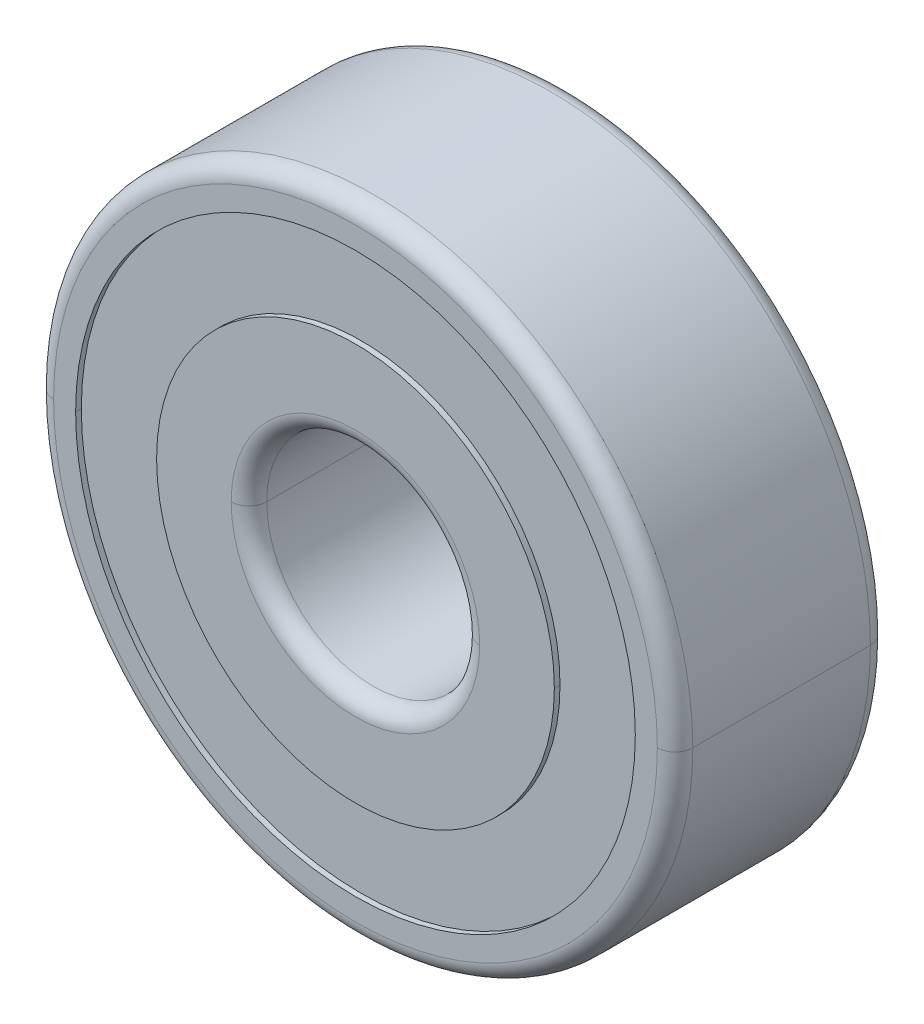
ISO-10303-21;
HEADER;
FILE_DESCRIPTION(('STEP AP214'),'2;1');
FILE_NAME('part.step','',(''),(''),'','','');
FILE_SCHEMA(('AUTOMOTIVE_DESIGN { 1 0 10303 214 1 1 1 1 }'));
ENDSEC;
DATA;
#1=APPLICATION_CONTEXT('core data for automotive mechanical design processes');
#2=APPLICATION_PROTOCOL_DEFINITION('international standard','automotive_design',2000,#1);
#3=PRODUCT_CONTEXT('',#1,'mechanical');
#4=PRODUCT('Part','Part','',(#3));
#5=PRODUCT_RELATED_PRODUCT_CATEGORY('part','',(#4));
#6=PRODUCT_DEFINITION_FORMATION('','',#4);
#7=PRODUCT_DEFINITION_CONTEXT('part definition',#1,'design');
#8=PRODUCT_DEFINITION('design','',#6,#7);
#9=PRODUCT_DEFINITION_SHAPE('','',#8);
#10=(LENGTH_UNIT() NAMED_UNIT(*) SI_UNIT(.MILLI.,.METRE.));
#11=(NAMED_UNIT(*) PLANE_ANGLE_UNIT() SI_UNIT($,.RADIAN.));
#12=(NAMED_UNIT(*) SI_UNIT($,.STERADIAN.) SOLID_ANGLE_UNIT());
#13=UNCERTAINTY_MEASURE_WITH_UNIT(LENGTH_MEASURE(1.E-05),#10,'distance_accuracy_value','');
#14=(GEOMETRIC_REPRESENTATION_CONTEXT(3) GLOBAL_UNCERTAINTY_ASSIGNED_CONTEXT((#13)) GLOBAL_UNIT_ASSIGNED_CONTEXT((#10,
#11,#12)) REPRESENTATION_CONTEXT('',''));
#15=CARTESIAN_POINT('',(0.,0.,0.));
#16=DIRECTION('',(0.,0.,1.));
#17=DIRECTION('',(1.,0.,0.));
#18=AXIS2_PLACEMENT_3D('',#15,#16,#17);
#19=CARTESIAN_POINT('',(0.,0.,-4.5085));
#20=DIRECTION('',(0.,0.,-1.));
#21=DIRECTION('',(-1.,0.,0.));
#22=AXIS2_PLACEMENT_3D('',#19,#20,#21);
#23=CYLINDRICAL_SURFACE('',#22,8.89);
#24=DIRECTION('',(0.,0.,-1.));
#25=VECTOR('',#24,1.);
#26=CARTESIAN_POINT('',(8.89,0.,-4.5085));
#27=LINE('',#26,#25);
#28=CARTESIAN_POINT('',(8.89,0.,-4.5085));
#29=VERTEX_POINT('',#28);
#30=CARTESIAN_POINT('',(8.89,0.,-4.7625));
#31=VERTEX_POINT('',#30);
#32=EDGE_CURVE('E390',#29,#31,#27,.T.);
#33=ORIENTED_EDGE('',*,*,#32,.F.);
#34=CARTESIAN_POINT('',(0.,0.,-4.5085));
#35=DIRECTION('',(0.,0.,1.));
#36=DIRECTION('',(1.,0.,0.));
#37=AXIS2_PLACEMENT_3D('',#34,#35,#36);
#38=CIRCLE('',#37,8.89);
#39=CARTESIAN_POINT('',(-8.89,0.,-4.5085));
#40=VERTEX_POINT('',#39);
#41=EDGE_CURVE('E11',#40,#29,#38,.T.);
#42=ORIENTED_EDGE('',*,*,#41,.F.);
#43=DIRECTION('',(0.,0.,-1.));
#44=VECTOR('',#43,1.);
#45=CARTESIAN_POINT('',(-8.89,0.,-4.5085));
#46=LINE('',#45,#44);
#47=CARTESIAN_POINT('',(-8.89,0.,-4.7625));
#48=VERTEX_POINT('',#47);
#49=EDGE_CURVE('E347',#40,#48,#46,.T.);
#50=ORIENTED_EDGE('',*,*,#49,.T.);
#51=CARTESIAN_POINT('',(0.,0.,-4.7625));
#52=DIRECTION('',(0.,0.,1.));
#53=DIRECTION('',(1.,0.,0.));
#54=AXIS2_PLACEMENT_3D('',#51,#52,#53);
#55=CIRCLE('',#54,8.89);
#56=EDGE_CURVE('E301',#48,#31,#55,.T.);
#57=ORIENTED_EDGE('',*,*,#56,.T.);
#58=EDGE_LOOP('',(#33,#42,#50,#57));
#59=FACE_BOUND('',#58,.T.);
#60=ADVANCED_FACE('F16',(#59),#23,.T.);
#61=CARTESIAN_POINT('',(0.,0.,-4.5085));
#62=DIRECTION('',(0.,0.,-1.));
#63=DIRECTION('',(-1.,0.,0.));
#64=AXIS2_PLACEMENT_3D('',#61,#62,#63);
#65=CYLINDRICAL_SURFACE('',#64,12.5095);
#66=DIRECTION('',(0.,0.,-1.));
#67=VECTOR('',#66,1.);
#68=CARTESIAN_POINT('',(12.5095,0.,-4.5085));
#69=LINE('',#68,#67);
#70=CARTESIAN_POINT('',(12.5095,0.,-4.5085));
#71=VERTEX_POINT('',#70);
#72=CARTESIAN_POINT('',(12.5095,0.,-4.7625));
#73=VERTEX_POINT('',#72);
#74=EDGE_CURVE('E338',#71,#73,#69,.T.);
#75=ORIENTED_EDGE('',*,*,#74,.F.);
#76=CARTESIAN_POINT('',(0.,0.,-4.5085));
#77=DIRECTION('',(0.,0.,1.));
#78=DIRECTION('',(1.,0.,0.));
#79=AXIS2_PLACEMENT_3D('',#76,#77,#78);
#80=CIRCLE('',#79,12.5095);
#81=CARTESIAN_POINT('',(-12.5095,0.,-4.5085));
#82=VERTEX_POINT('',#81);
#83=EDGE_CURVE('E25',#71,#82,#80,.T.);
#84=ORIENTED_EDGE('',*,*,#83,.T.);
#85=DIRECTION('',(0.,0.,-1.));
#86=VECTOR('',#85,1.);
#87=CARTESIAN_POINT('',(-12.5095,0.,-4.5085));
#88=LINE('',#87,#86);
#89=CARTESIAN_POINT('',(-12.5095,0.,-4.7625));
#90=VERTEX_POINT('',#89);
#91=EDGE_CURVE('E204',#82,#90,#88,.T.);
#92=ORIENTED_EDGE('',*,*,#91,.T.);
#93=CARTESIAN_POINT('',(0.,0.,-4.7625));
#94=DIRECTION('',(0.,0.,1.));
#95=DIRECTION('',(1.,0.,0.));
#96=AXIS2_PLACEMENT_3D('',#93,#94,#95);
#97=CIRCLE('',#96,12.5095);
#98=EDGE_CURVE('E180',#73,#90,#97,.T.);
#99=ORIENTED_EDGE('',*,*,#98,.F.);
#100=EDGE_LOOP('',(#75,#84,#92,#99));
#101=FACE_BOUND('',#100,.T.);
#102=ADVANCED_FACE('F331',(#101),#65,.F.);
#103=CARTESIAN_POINT('',(0.,0.,-4.5085));
#104=DIRECTION('',(0.,0.,-1.));
#105=DIRECTION('',(0.,-1.,0.));
#106=AXIS2_PLACEMENT_3D('',#103,#104,#105);
#107=PLANE('',#106);
#108=ORIENTED_EDGE('',*,*,#41,.T.);
#109=CARTESIAN_POINT('',(0.,0.,-4.5085));
#110=DIRECTION('',(0.,0.,1.));
#111=DIRECTION('',(1.,0.,0.));
#112=AXIS2_PLACEMENT_3D('',#109,#110,#111);
#113=CIRCLE('',#112,8.89);
#114=EDGE_CURVE('E382',#29,#40,#113,.T.);
#115=ORIENTED_EDGE('',*,*,#114,.T.);
#116=EDGE_LOOP('',(#108,#115));
#117=FACE_BOUND('',#116,.T.);
#118=CARTESIAN_POINT('',(0.,0.,-4.5085));
#119=DIRECTION('',(0.,0.,1.));
#120=DIRECTION('',(1.,0.,0.));
#121=AXIS2_PLACEMENT_3D('',#118,#119,#120);
#122=CIRCLE('',#121,12.5095);
#123=EDGE_CURVE('E341',#82,#71,#122,.T.);
#124=ORIENTED_EDGE('',*,*,#123,.F.);
#125=ORIENTED_EDGE('',*,*,#83,.F.);
#126=EDGE_LOOP('',(#124,#125));
#127=FACE_BOUND('',#126,.T.);
#128=ADVANCED_FACE('F431',(#117,#127),#107,.T.);
#129=CARTESIAN_POINT('',(0.,0.,4.5085));
#130=DIRECTION('',(0.,0.,1.));
#131=DIRECTION('',(1.,0.,0.));
#132=AXIS2_PLACEMENT_3D('',#129,#130,#131);
#133=CYLINDRICAL_SURFACE('',#132,8.89);
#134=DIRECTION('',(0.,0.,1.));
#135=VECTOR('',#134,1.);
#136=CARTESIAN_POINT('',(-8.89,0.,4.5085));
#137=LINE('',#136,#135);
#138=CARTESIAN_POINT('',(-8.89,0.,4.5085));
#139=VERTEX_POINT('',#138);
#140=CARTESIAN_POINT('',(-8.89,0.,4.7625));
#141=VERTEX_POINT('',#140);
#142=EDGE_CURVE('E220',#139,#141,#137,.T.);
#143=ORIENTED_EDGE('',*,*,#142,.F.);
#144=CARTESIAN_POINT('',(0.,0.,4.5085));
#145=DIRECTION('',(0.,0.,1.));
#146=DIRECTION('',(1.,0.,0.));
#147=AXIS2_PLACEMENT_3D('',#144,#145,#146);
#148=CIRCLE('',#147,8.89);
#149=CARTESIAN_POINT('',(8.89,0.,4.5085));
#150=VERTEX_POINT('',#149);
#151=EDGE_CURVE('E19',#139,#150,#148,.T.);
#152=ORIENTED_EDGE('',*,*,#151,.T.);
#153=DIRECTION('',(0.,0.,1.));
#154=VECTOR('',#153,1.);
#155=CARTESIAN_POINT('',(8.89,0.,4.5085));
#156=LINE('',#155,#154);
#157=CARTESIAN_POINT('',(8.89,0.,4.7625));
#158=VERTEX_POINT('',#157);
#159=EDGE_CURVE('E192',#150,#158,#156,.T.);
#160=ORIENTED_EDGE('',*,*,#159,.T.);
#161=CARTESIAN_POINT('',(0.,0.,4.7625));
#162=DIRECTION('',(0.,0.,1.));
#163=DIRECTION('',(1.,0.,0.));
#164=AXIS2_PLACEMENT_3D('',#161,#162,#163);
#165=CIRCLE('',#164,8.89);
#166=EDGE_CURVE('E310',#141,#158,#165,.T.);
#167=ORIENTED_EDGE('',*,*,#166,.F.);
#168=EDGE_LOOP('',(#143,#152,#160,#167));
#169=FACE_BOUND('',#168,.T.);
#170=ADVANCED_FACE('F436',(#169),#133,.T.);
#171=CARTESIAN_POINT('',(0.,0.,4.5085));
#172=DIRECTION('',(0.,0.,1.));
#173=DIRECTION('',(1.,0.,0.));
#174=AXIS2_PLACEMENT_3D('',#171,#172,#173);
#175=PLANE('',#174);
#176=CARTESIAN_POINT('',(0.,0.,4.5085));
#177=DIRECTION('',(0.,0.,1.));
#178=DIRECTION('',(1.,0.,0.));
#179=AXIS2_PLACEMENT_3D('',#176,#177,#178);
#180=CIRCLE('',#179,8.89);
#181=EDGE_CURVE('E208',#150,#139,#180,.T.);
#182=ORIENTED_EDGE('',*,*,#181,.F.);
#183=ORIENTED_EDGE('',*,*,#151,.F.);
#184=EDGE_LOOP('',(#182,#183));
#185=FACE_BOUND('',#184,.T.);
#186=CARTESIAN_POINT('',(0.,0.,4.5085));
#187=DIRECTION('',(0.,0.,1.));
#188=DIRECTION('',(1.,0.,0.));
#189=AXIS2_PLACEMENT_3D('',#186,#187,#188);
#190=CIRCLE('',#189,12.5095);
#191=CARTESIAN_POINT('',(12.5095,0.,4.5085));
#192=VERTEX_POINT('',#191);
#193=CARTESIAN_POINT('',(-12.5095,0.,4.5085));
#194=VERTEX_POINT('',#193);
#195=EDGE_CURVE('E169',#192,#194,#190,.T.);
#196=ORIENTED_EDGE('',*,*,#195,.T.);
#197=CARTESIAN_POINT('',(0.,0.,4.5085));
#198=DIRECTION('',(0.,0.,1.));
#199=DIRECTION('',(1.,0.,0.));
#200=AXIS2_PLACEMENT_3D('',#197,#198,#199);
#201=CIRCLE('',#200,12.5095);
#202=EDGE_CURVE('E172',#194,#192,#201,.T.);
#203=ORIENTED_EDGE('',*,*,#202,.T.);
#204=EDGE_LOOP('',(#196,#203));
#205=FACE_BOUND('',#204,.T.);
#206=ADVANCED_FACE('F168',(#185,#205),#175,.T.);
#207=CARTESIAN_POINT('',(0.,0.,4.5085));
#208=DIRECTION('',(0.,0.,1.));
#209=DIRECTION('',(1.,0.,0.));
#210=AXIS2_PLACEMENT_3D('',#207,#208,#209);
#211=CYLINDRICAL_SURFACE('',#210,12.5095);
#212=DIRECTION('',(0.,0.,1.));
#213=VECTOR('',#212,1.);
#214=CARTESIAN_POINT('',(-12.5095,0.,4.5085));
#215=LINE('',#214,#213);
#216=CARTESIAN_POINT('',(-12.5095,0.,4.7625));
#217=VERTEX_POINT('',#216);
#218=EDGE_CURVE('E176',#194,#217,#215,.T.);
#219=ORIENTED_EDGE('',*,*,#218,.F.);
#220=ORIENTED_EDGE('',*,*,#195,.F.);
#221=DIRECTION('',(0.,0.,1.));
#222=VECTOR('',#221,1.);
#223=CARTESIAN_POINT('',(12.5095,0.,4.5085));
#224=LINE('',#223,#222);
#225=CARTESIAN_POINT('',(12.5095,0.,4.7625));
#226=VERTEX_POINT('',#225);
#227=EDGE_CURVE('E188',#192,#226,#224,.T.);
#228=ORIENTED_EDGE('',*,*,#227,.T.);
#229=CARTESIAN_POINT('',(0.,0.,4.7625));
#230=DIRECTION('',(0.,0.,1.));
#231=DIRECTION('',(1.,0.,0.));
#232=AXIS2_PLACEMENT_3D('',#229,#230,#231);
#233=CIRCLE('',#232,12.5095);
#234=EDGE_CURVE('E185',#226,#217,#233,.T.);
#235=ORIENTED_EDGE('',*,*,#234,.T.);
#236=EDGE_LOOP('',(#219,#220,#228,#235));
#237=FACE_BOUND('',#236,.T.);
#238=ADVANCED_FACE('F178',(#237),#211,.F.);
#239=CARTESIAN_POINT('',(0.,0.,-4.7625));
#240=DIRECTION('',(0.,0.,1.));
#241=DIRECTION('',(1.,0.,0.));
#242=AXIS2_PLACEMENT_3D('',#239,#240,#241);
#243=PLANE('',#242);
#244=CARTESIAN_POINT('',(0.,0.,-4.7625));
#245=DIRECTION('',(0.,0.,1.));
#246=DIRECTION('',(1.,0.,0.));
#247=AXIS2_PLACEMENT_3D('',#244,#245,#246);
#248=CIRCLE('',#247,12.5095);
#249=EDGE_CURVE('E205',#90,#73,#248,.T.);
#250=ORIENTED_EDGE('',*,*,#249,.T.);
#251=ORIENTED_EDGE('',*,*,#98,.T.);
#252=EDGE_LOOP('',(#250,#251));
#253=FACE_BOUND('',#252,.T.);
#254=CARTESIAN_POINT('',(0.,0.,-4.7625));
#255=DIRECTION('',(0.,0.,-1.));
#256=DIRECTION('',(-1.,0.,0.));
#257=AXIS2_PLACEMENT_3D('',#254,#255,#256);
#258=CIRCLE('',#257,13.49375);
#259=CARTESIAN_POINT('',(-13.49375,0.,-4.7625));
#260=VERTEX_POINT('',#259);
#261=CARTESIAN_POINT('',(13.49375,0.,-4.7625));
#262=VERTEX_POINT('',#261);
#263=EDGE_CURVE('E221',#260,#262,#258,.T.);
#264=ORIENTED_EDGE('',*,*,#263,.T.);
#265=CARTESIAN_POINT('',(0.,0.,-4.7625));
#266=DIRECTION('',(0.,0.,-1.));
#267=DIRECTION('',(-1.,0.,0.));
#268=AXIS2_PLACEMENT_3D('',#265,#266,#267);
#269=CIRCLE('',#268,13.49375);
#270=EDGE_CURVE('E227',#262,#260,#269,.T.);
#271=ORIENTED_EDGE('',*,*,#270,.T.);
#272=EDGE_LOOP('',(#264,#271));
#273=FACE_BOUND('',#272,.T.);
#274=ADVANCED_FACE('F330',(#253,#273),#243,.F.);
#275=CARTESIAN_POINT('',(0.,0.,-3.96875));
#276=DIRECTION('',(0.,0.,1.));
#277=DIRECTION('',(-1.,0.,0.));
#278=AXIS2_PLACEMENT_3D('',#275,#276,#277);
#279=TOROIDAL_SURFACE('',#278,13.49375,0.79375);
#280=CARTESIAN_POINT('',(13.49375,0.,-3.96875));
#281=DIRECTION('',(0.,-1.,0.));
#282=DIRECTION('',(1.,0.,0.));
#283=AXIS2_PLACEMENT_3D('',#280,#281,#282);
#284=CIRCLE('',#283,0.79375);
#285=CARTESIAN_POINT('',(14.2875,0.,-3.96875));
#286=VERTEX_POINT('',#285);
#287=EDGE_CURVE('E230',#262,#286,#284,.T.);
#288=ORIENTED_EDGE('',*,*,#287,.F.);
#289=ORIENTED_EDGE('',*,*,#263,.F.);
#290=CARTESIAN_POINT('',(-13.49375,0.,-3.96875));
#291=DIRECTION('',(0.,1.,0.));
#292=DIRECTION('',(0.,0.,1.));
#293=AXIS2_PLACEMENT_3D('',#290,#291,#292);
#294=CIRCLE('',#293,0.79375);
#295=CARTESIAN_POINT('',(-14.2875,0.,-3.96875));
#296=VERTEX_POINT('',#295);
#297=EDGE_CURVE('E242',#260,#296,#294,.T.);
#298=ORIENTED_EDGE('',*,*,#297,.T.);
#299=CARTESIAN_POINT('',(0.,0.,-3.96875));
#300=DIRECTION('',(0.,0.,1.));
#301=DIRECTION('',(-1.,0.,0.));
#302=AXIS2_PLACEMENT_3D('',#299,#300,#301);
#303=CIRCLE('',#302,14.2875);
#304=EDGE_CURVE('E254',#286,#296,#303,.T.);
#305=ORIENTED_EDGE('',*,*,#304,.F.);
#306=EDGE_LOOP('',(#288,#289,#298,#305));
#307=FACE_BOUND('',#306,.T.);
#308=ADVANCED_FACE('F364',(#307),#279,.T.);
#309=CARTESIAN_POINT('',(0.,0.,4.7625));
#310=DIRECTION('',(0.,0.,1.));
#311=DIRECTION('',(1.,0.,0.));
#312=AXIS2_PLACEMENT_3D('',#309,#310,#311);
#313=PLANE('',#312);
#314=ORIENTED_EDGE('',*,*,#234,.F.);
#315=CARTESIAN_POINT('',(0.,0.,4.7625));
#316=DIRECTION('',(0.,0.,1.));
#317=DIRECTION('',(1.,0.,0.));
#318=AXIS2_PLACEMENT_3D('',#315,#316,#317);
#319=CIRCLE('',#318,12.5095);
#320=EDGE_CURVE('E186',#217,#226,#319,.T.);
#321=ORIENTED_EDGE('',*,*,#320,.F.);
#322=EDGE_LOOP('',(#314,#321));
#323=FACE_BOUND('',#322,.T.);
#324=CARTESIAN_POINT('',(0.,0.,4.7625));
#325=DIRECTION('',(0.,0.,1.));
#326=DIRECTION('',(-1.,0.,0.));
#327=AXIS2_PLACEMENT_3D('',#324,#325,#326);
#328=CIRCLE('',#327,13.49375);
#329=CARTESIAN_POINT('',(13.49375,0.,4.7625));
#330=VERTEX_POINT('',#329);
#331=CARTESIAN_POINT('',(-13.49375,0.,4.7625));
#332=VERTEX_POINT('',#331);
#333=EDGE_CURVE('E282',#330,#332,#328,.T.);
#334=ORIENTED_EDGE('',*,*,#333,.T.);
#335=CARTESIAN_POINT('',(0.,0.,4.7625));
#336=DIRECTION('',(0.,0.,1.));
#337=DIRECTION('',(-1.,0.,0.));
#338=AXIS2_PLACEMENT_3D('',#335,#336,#337);
#339=CIRCLE('',#338,13.49375);
#340=EDGE_CURVE('E265',#332,#330,#339,.T.);
#341=ORIENTED_EDGE('',*,*,#340,.T.);
#342=EDGE_LOOP('',(#334,#341));
#343=FACE_BOUND('',#342,.T.);
#344=ADVANCED_FACE('F363',(#323,#343),#313,.T.);
#345=CARTESIAN_POINT('',(0.,0.,0.));
#346=DIRECTION('',(0.,0.,-1.));
#347=DIRECTION('',(-1.,0.,0.));
#348=AXIS2_PLACEMENT_3D('',#345,#346,#347);
#349=CYLINDRICAL_SURFACE('',#348,14.2875);
#350=DIRECTION('',(0.,0.,-1.));
#351=VECTOR('',#350,1.);
#352=CARTESIAN_POINT('',(14.2875,0.,0.));
#353=LINE('',#352,#351);
#354=CARTESIAN_POINT('',(14.2875,0.,3.96875));
#355=VERTEX_POINT('',#354);
#356=EDGE_CURVE('E253',#355,#286,#353,.T.);
#357=ORIENTED_EDGE('',*,*,#356,.F.);
#358=CARTESIAN_POINT('',(0.,0.,3.96875));
#359=DIRECTION('',(0.,0.,-1.));
#360=DIRECTION('',(-1.,0.,0.));
#361=AXIS2_PLACEMENT_3D('',#358,#359,#360);
#362=CIRCLE('',#361,14.2875);
#363=CARTESIAN_POINT('',(-14.2875,0.,3.96875));
#364=VERTEX_POINT('',#363);
#365=EDGE_CURVE('E213',#355,#364,#362,.T.);
#366=ORIENTED_EDGE('',*,*,#365,.T.);
#367=DIRECTION('',(0.,0.,-1.));
#368=VECTOR('',#367,1.);
#369=CARTESIAN_POINT('',(-14.2875,0.,0.));
#370=LINE('',#369,#368);
#371=EDGE_CURVE('E259',#364,#296,#370,.T.);
#372=ORIENTED_EDGE('',*,*,#371,.T.);
#373=CARTESIAN_POINT('',(0.,0.,-3.96875));
#374=DIRECTION('',(0.,0.,1.));
#375=DIRECTION('',(-1.,0.,0.));
#376=AXIS2_PLACEMENT_3D('',#373,#374,#375);
#377=CIRCLE('',#376,14.2875);
#378=EDGE_CURVE('E233',#296,#286,#377,.T.);
#379=ORIENTED_EDGE('',*,*,#378,.T.);
#380=EDGE_LOOP('',(#357,#366,#372,#379));
#381=FACE_BOUND('',#380,.T.);
#382=ADVANCED_FACE('F365',(#381),#349,.T.);
#383=CARTESIAN_POINT('',(0.,0.,3.96875));
#384=DIRECTION('',(0.,0.,-1.));
#385=DIRECTION('',(1.,0.,0.));
#386=AXIS2_PLACEMENT_3D('',#383,#384,#385);
#387=TOROIDAL_SURFACE('',#386,13.49375,0.79375);
#388=CARTESIAN_POINT('',(-13.49375,0.,3.96875));
#389=DIRECTION('',(0.,-1.,0.));
#390=DIRECTION('',(1.,0.,0.));
#391=AXIS2_PLACEMENT_3D('',#388,#389,#390);
#392=CIRCLE('',#391,0.79375);
#393=EDGE_CURVE('E263',#332,#364,#392,.T.);
#394=ORIENTED_EDGE('',*,*,#393,.F.);
#395=ORIENTED_EDGE('',*,*,#333,.F.);
#396=CARTESIAN_POINT('',(13.49375,0.,3.96875));
#397=DIRECTION('',(0.,1.,0.));
#398=DIRECTION('',(0.,0.,1.));
#399=AXIS2_PLACEMENT_3D('',#396,#397,#398);
#400=CIRCLE('',#399,0.79375);
#401=EDGE_CURVE('E207',#330,#355,#400,.T.);
#402=ORIENTED_EDGE('',*,*,#401,.T.);
#403=CARTESIAN_POINT('',(0.,0.,3.96875));
#404=DIRECTION('',(0.,0.,-1.));
#405=DIRECTION('',(-1.,0.,0.));
#406=AXIS2_PLACEMENT_3D('',#403,#404,#405);
#407=CIRCLE('',#406,14.2875);
#408=EDGE_CURVE('E250',#364,#355,#407,.T.);
#409=ORIENTED_EDGE('',*,*,#408,.F.);
#410=EDGE_LOOP('',(#394,#395,#402,#409));
#411=FACE_BOUND('',#410,.T.);
#412=ADVANCED_FACE('F373',(#411),#387,.T.);
#413=CARTESIAN_POINT('',(0.,0.,3.96875));
#414=DIRECTION('',(0.,0.,1.));
#415=DIRECTION('',(-1.,0.,0.));
#416=AXIS2_PLACEMENT_3D('',#413,#414,#415);
#417=TOROIDAL_SURFACE('',#416,5.55625,0.79375);
#418=CARTESIAN_POINT('',(5.55625,0.,3.96875));
#419=DIRECTION('',(0.,-1.,0.));
#420=DIRECTION('',(1.,0.,0.));
#421=AXIS2_PLACEMENT_3D('',#418,#419,#420);
#422=CIRCLE('',#421,0.79375);
#423=CARTESIAN_POINT('',(5.55625,0.,4.7625));
#424=VERTEX_POINT('',#423);
#425=CARTESIAN_POINT('',(4.7625,0.,3.96875));
#426=VERTEX_POINT('',#425);
#427=EDGE_CURVE('E237',#424,#426,#422,.T.);
#428=ORIENTED_EDGE('',*,*,#427,.F.);
#429=CARTESIAN_POINT('',(0.,0.,4.7625));
#430=DIRECTION('',(0.,0.,1.));
#431=DIRECTION('',(-1.,0.,0.));
#432=AXIS2_PLACEMENT_3D('',#429,#430,#431);
#433=CIRCLE('',#432,5.55625);
#434=CARTESIAN_POINT('',(-5.55625,0.,4.7625));
#435=VERTEX_POINT('',#434);
#436=EDGE_CURVE('E315',#424,#435,#433,.T.);
#437=ORIENTED_EDGE('',*,*,#436,.T.);
#438=CARTESIAN_POINT('',(-5.55625,0.,3.96875));
#439=DIRECTION('',(0.,1.,0.));
#440=DIRECTION('',(0.,0.,1.));
#441=AXIS2_PLACEMENT_3D('',#438,#439,#440);
#442=CIRCLE('',#441,0.79375);
#443=CARTESIAN_POINT('',(-4.7625,0.,3.96875));
#444=VERTEX_POINT('',#443);
#445=EDGE_CURVE('E272',#435,#444,#442,.T.);
#446=ORIENTED_EDGE('',*,*,#445,.T.);
#447=CARTESIAN_POINT('',(0.,0.,3.96875));
#448=DIRECTION('',(0.,0.,-1.));
#449=DIRECTION('',(-1.,0.,0.));
#450=AXIS2_PLACEMENT_3D('',#447,#448,#449);
#451=CIRCLE('',#450,4.7625);
#452=EDGE_CURVE('E285',#444,#426,#451,.T.);
#453=ORIENTED_EDGE('',*,*,#452,.T.);
#454=EDGE_LOOP('',(#428,#437,#446,#453));
#455=FACE_BOUND('',#454,.T.);
#456=ADVANCED_FACE('F460',(#455),#417,.T.);
#457=CARTESIAN_POINT('',(0.,0.,0.));
#458=DIRECTION('',(0.,0.,-1.));
#459=DIRECTION('',(-1.,0.,0.));
#460=AXIS2_PLACEMENT_3D('',#457,#458,#459);
#461=CYLINDRICAL_SURFACE('',#460,4.7625);
#462=DIRECTION('',(0.,0.,-1.));
#463=VECTOR('',#462,1.);
#464=CARTESIAN_POINT('',(4.7625,0.,0.));
#465=LINE('',#464,#463);
#466=CARTESIAN_POINT('',(4.7625,0.,-3.96875));
#467=VERTEX_POINT('',#466);
#468=EDGE_CURVE('E280',#426,#467,#465,.T.);
#469=ORIENTED_EDGE('',*,*,#468,.F.);
#470=ORIENTED_EDGE('',*,*,#452,.F.);
#471=DIRECTION('',(0.,0.,-1.));
#472=VECTOR('',#471,1.);
#473=CARTESIAN_POINT('',(-4.7625,0.,0.));
#474=LINE('',#473,#472);
#475=CARTESIAN_POINT('',(-4.7625,0.,-3.96875));
#476=VERTEX_POINT('',#475);
#477=EDGE_CURVE('E286',#444,#476,#474,.T.);
#478=ORIENTED_EDGE('',*,*,#477,.T.);
#479=CARTESIAN_POINT('',(0.,0.,-3.96875));
#480=DIRECTION('',(0.,0.,1.));
#481=DIRECTION('',(-1.,0.,0.));
#482=AXIS2_PLACEMENT_3D('',#479,#480,#481);
#483=CIRCLE('',#482,4.7625);
#484=EDGE_CURVE('E312',#467,#476,#483,.T.);
#485=ORIENTED_EDGE('',*,*,#484,.F.);
#486=EDGE_LOOP('',(#469,#470,#478,#485));
#487=FACE_BOUND('',#486,.T.);
#488=ADVANCED_FACE('F457',(#487),#461,.F.);
#489=CARTESIAN_POINT('',(0.,0.,-3.96875));
#490=DIRECTION('',(0.,0.,1.));
#491=DIRECTION('',(-1.,0.,0.));
#492=AXIS2_PLACEMENT_3D('',#489,#490,#491);
#493=TOROIDAL_SURFACE('',#492,5.55625,0.79375);
#494=CARTESIAN_POINT('',(5.55625,0.,-3.96875));
#495=DIRECTION('',(0.,-1.,0.));
#496=DIRECTION('',(1.,0.,0.));
#497=AXIS2_PLACEMENT_3D('',#494,#495,#496);
#498=CIRCLE('',#497,0.79375);
#499=CARTESIAN_POINT('',(5.55625,0.,-4.7625));
#500=VERTEX_POINT('',#499);
#501=EDGE_CURVE('E293',#467,#500,#498,.T.);
#502=ORIENTED_EDGE('',*,*,#501,.F.);
#503=ORIENTED_EDGE('',*,*,#484,.T.);
#504=CARTESIAN_POINT('',(-5.55625,0.,-3.96875));
#505=DIRECTION('',(0.,1.,0.));
#506=DIRECTION('',(0.,0.,1.));
#507=AXIS2_PLACEMENT_3D('',#504,#505,#506);
#508=CIRCLE('',#507,0.79375);
#509=CARTESIAN_POINT('',(-5.55625,0.,-4.7625));
#510=VERTEX_POINT('',#509);
#511=EDGE_CURVE('E302',#476,#510,#508,.T.);
#512=ORIENTED_EDGE('',*,*,#511,.T.);
#513=CARTESIAN_POINT('',(0.,0.,-4.7625));
#514=DIRECTION('',(0.,0.,-1.));
#515=DIRECTION('',(-1.,0.,0.));
#516=AXIS2_PLACEMENT_3D('',#513,#514,#515);
#517=CIRCLE('',#516,5.55625);
#518=EDGE_CURVE('E36',#510,#500,#517,.T.);
#519=ORIENTED_EDGE('',*,*,#518,.T.);
#520=EDGE_LOOP('',(#502,#503,#512,#519));
#521=FACE_BOUND('',#520,.T.);
#522=ADVANCED_FACE('F423',(#521),#493,.T.);
#523=CARTESIAN_POINT('',(0.,0.,4.7625));
#524=DIRECTION('',(0.,0.,1.));
#525=DIRECTION('',(1.,0.,0.));
#526=AXIS2_PLACEMENT_3D('',#523,#524,#525);
#527=PLANE('',#526);
#528=CARTESIAN_POINT('',(0.,0.,4.7625));
#529=DIRECTION('',(0.,0.,1.));
#530=DIRECTION('',(-1.,0.,0.));
#531=AXIS2_PLACEMENT_3D('',#528,#529,#530);
#532=CIRCLE('',#531,5.55625);
#533=EDGE_CURVE('E215',#435,#424,#532,.T.);
#534=ORIENTED_EDGE('',*,*,#533,.F.);
#535=ORIENTED_EDGE('',*,*,#436,.F.);
#536=EDGE_LOOP('',(#534,#535));
#537=FACE_BOUND('',#536,.T.);
#538=CARTESIAN_POINT('',(0.,0.,4.7625));
#539=DIRECTION('',(0.,0.,1.));
#540=DIRECTION('',(1.,0.,0.));
#541=AXIS2_PLACEMENT_3D('',#538,#539,#540);
#542=CIRCLE('',#541,8.89);
#543=EDGE_CURVE('E196',#158,#141,#542,.T.);
#544=ORIENTED_EDGE('',*,*,#543,.T.);
#545=ORIENTED_EDGE('',*,*,#166,.T.);
#546=EDGE_LOOP('',(#544,#545));
#547=FACE_BOUND('',#546,.T.);
#548=ADVANCED_FACE('F409',(#537,#547),#527,.T.);
#549=CARTESIAN_POINT('',(0.,0.,-4.7625));
#550=DIRECTION('',(0.,0.,1.));
#551=DIRECTION('',(1.,0.,0.));
#552=AXIS2_PLACEMENT_3D('',#549,#550,#551);
#553=PLANE('',#552);
#554=ORIENTED_EDGE('',*,*,#518,.F.);
#555=CARTESIAN_POINT('',(0.,0.,-4.7625));
#556=DIRECTION('',(0.,0.,-1.));
#557=DIRECTION('',(-1.,0.,0.));
#558=AXIS2_PLACEMENT_3D('',#555,#556,#557);
#559=CIRCLE('',#558,5.55625);
#560=EDGE_CURVE('E300',#500,#510,#559,.T.);
#561=ORIENTED_EDGE('',*,*,#560,.F.);
#562=EDGE_LOOP('',(#554,#561));
#563=FACE_BOUND('',#562,.T.);
#564=ORIENTED_EDGE('',*,*,#56,.F.);
#565=CARTESIAN_POINT('',(0.,0.,-4.7625));
#566=DIRECTION('',(0.,0.,1.));
#567=DIRECTION('',(1.,0.,0.));
#568=AXIS2_PLACEMENT_3D('',#565,#566,#567);
#569=CIRCLE('',#568,8.89);
#570=EDGE_CURVE('E389',#31,#48,#569,.T.);
#571=ORIENTED_EDGE('',*,*,#570,.F.);
#572=EDGE_LOOP('',(#564,#571));
#573=FACE_BOUND('',#572,.T.);
#574=ADVANCED_FACE('F410',(#563,#573),#553,.F.);
#575=CARTESIAN_POINT('',(0.,0.,-3.96875));
#576=DIRECTION('',(0.,0.,1.));
#577=DIRECTION('',(-1.,0.,0.));
#578=AXIS2_PLACEMENT_3D('',#575,#576,#577);
#579=TOROIDAL_SURFACE('',#578,5.55625,0.79375);
#580=CARTESIAN_POINT('',(0.,0.,-3.96875));
#581=DIRECTION('',(0.,0.,1.));
#582=DIRECTION('',(-1.,0.,0.));
#583=AXIS2_PLACEMENT_3D('',#580,#581,#582);
#584=CIRCLE('',#583,4.7625);
#585=EDGE_CURVE('E281',#476,#467,#584,.T.);
#586=ORIENTED_EDGE('',*,*,#585,.T.);
#587=ORIENTED_EDGE('',*,*,#501,.T.);
#588=ORIENTED_EDGE('',*,*,#560,.T.);
#589=ORIENTED_EDGE('',*,*,#511,.F.);
#590=EDGE_LOOP('',(#586,#587,#588,#589));
#591=FACE_BOUND('',#590,.T.);
#592=ADVANCED_FACE('F408',(#591),#579,.T.);
#593=CARTESIAN_POINT('',(0.,0.,0.));
#594=DIRECTION('',(0.,0.,-1.));
#595=DIRECTION('',(-1.,0.,0.));
#596=AXIS2_PLACEMENT_3D('',#593,#594,#595);
#597=CYLINDRICAL_SURFACE('',#596,4.7625);
#598=CARTESIAN_POINT('',(0.,0.,3.96875));
#599=DIRECTION('',(0.,0.,-1.));
#600=DIRECTION('',(-1.,0.,0.));
#601=AXIS2_PLACEMENT_3D('',#598,#599,#600);
#602=CIRCLE('',#601,4.7625);
#603=EDGE_CURVE('E275',#426,#444,#602,.T.);
#604=ORIENTED_EDGE('',*,*,#603,.F.);
#605=ORIENTED_EDGE('',*,*,#468,.T.);
#606=ORIENTED_EDGE('',*,*,#585,.F.);
#607=ORIENTED_EDGE('',*,*,#477,.F.);
#608=EDGE_LOOP('',(#604,#605,#606,#607));
#609=FACE_BOUND('',#608,.T.);
#610=ADVANCED_FACE('F416',(#609),#597,.F.);
#611=CARTESIAN_POINT('',(0.,0.,3.96875));
#612=DIRECTION('',(0.,0.,1.));
#613=DIRECTION('',(-1.,0.,0.));
#614=AXIS2_PLACEMENT_3D('',#611,#612,#613);
#615=TOROIDAL_SURFACE('',#614,5.55625,0.79375);
#616=ORIENTED_EDGE('',*,*,#533,.T.);
#617=ORIENTED_EDGE('',*,*,#427,.T.);
#618=ORIENTED_EDGE('',*,*,#603,.T.);
#619=ORIENTED_EDGE('',*,*,#445,.F.);
#620=EDGE_LOOP('',(#616,#617,#618,#619));
#621=FACE_BOUND('',#620,.T.);
#622=ADVANCED_FACE('F469',(#621),#615,.T.);
#623=CARTESIAN_POINT('',(0.,0.,3.96875));
#624=DIRECTION('',(0.,0.,-1.));
#625=DIRECTION('',(1.,0.,0.));
#626=AXIS2_PLACEMENT_3D('',#623,#624,#625);
#627=TOROIDAL_SURFACE('',#626,13.49375,0.79375);
#628=ORIENTED_EDGE('',*,*,#340,.F.);
#629=ORIENTED_EDGE('',*,*,#393,.T.);
#630=ORIENTED_EDGE('',*,*,#365,.F.);
#631=ORIENTED_EDGE('',*,*,#401,.F.);
#632=EDGE_LOOP('',(#628,#629,#630,#631));
#633=FACE_BOUND('',#632,.T.);
#634=ADVANCED_FACE('F380',(#633),#627,.T.);
#635=CARTESIAN_POINT('',(0.,0.,0.));
#636=DIRECTION('',(0.,0.,-1.));
#637=DIRECTION('',(-1.,0.,0.));
#638=AXIS2_PLACEMENT_3D('',#635,#636,#637);
#639=CYLINDRICAL_SURFACE('',#638,14.2875);
#640=ORIENTED_EDGE('',*,*,#408,.T.);
#641=ORIENTED_EDGE('',*,*,#356,.T.);
#642=ORIENTED_EDGE('',*,*,#304,.T.);
#643=ORIENTED_EDGE('',*,*,#371,.F.);
#644=EDGE_LOOP('',(#640,#641,#642,#643));
#645=FACE_BOUND('',#644,.T.);
#646=ADVANCED_FACE('F470',(#645),#639,.T.);
#647=CARTESIAN_POINT('',(0.,0.,-3.96875));
#648=DIRECTION('',(0.,0.,1.));
#649=DIRECTION('',(-1.,0.,0.));
#650=AXIS2_PLACEMENT_3D('',#647,#648,#649);
#651=TOROIDAL_SURFACE('',#650,13.49375,0.79375);
#652=ORIENTED_EDGE('',*,*,#270,.F.);
#653=ORIENTED_EDGE('',*,*,#287,.T.);
#654=ORIENTED_EDGE('',*,*,#378,.F.);
#655=ORIENTED_EDGE('',*,*,#297,.F.);
#656=EDGE_LOOP('',(#652,#653,#654,#655));
#657=FACE_BOUND('',#656,.T.);
#658=ADVANCED_FACE('F474',(#657),#651,.T.);
#659=CARTESIAN_POINT('',(0.,0.,4.5085));
#660=DIRECTION('',(0.,0.,1.));
#661=DIRECTION('',(1.,0.,0.));
#662=AXIS2_PLACEMENT_3D('',#659,#660,#661);
#663=CYLINDRICAL_SURFACE('',#662,12.5095);
#664=ORIENTED_EDGE('',*,*,#202,.F.);
#665=ORIENTED_EDGE('',*,*,#218,.T.);
#666=ORIENTED_EDGE('',*,*,#320,.T.);
#667=ORIENTED_EDGE('',*,*,#227,.F.);
#668=EDGE_LOOP('',(#664,#665,#666,#667));
#669=FACE_BOUND('',#668,.T.);
#670=ADVANCED_FACE('F187',(#669),#663,.F.);
#671=CARTESIAN_POINT('',(0.,0.,4.5085));
#672=DIRECTION('',(0.,0.,1.));
#673=DIRECTION('',(1.,0.,0.));
#674=AXIS2_PLACEMENT_3D('',#671,#672,#673);
#675=CYLINDRICAL_SURFACE('',#674,8.89);
#676=ORIENTED_EDGE('',*,*,#181,.T.);
#677=ORIENTED_EDGE('',*,*,#142,.T.);
#678=ORIENTED_EDGE('',*,*,#543,.F.);
#679=ORIENTED_EDGE('',*,*,#159,.F.);
#680=EDGE_LOOP('',(#676,#677,#678,#679));
#681=FACE_BOUND('',#680,.T.);
#682=ADVANCED_FACE('F490',(#681),#675,.T.);
#683=CARTESIAN_POINT('',(0.,0.,-4.5085));
#684=DIRECTION('',(0.,0.,-1.));
#685=DIRECTION('',(-1.,0.,0.));
#686=AXIS2_PLACEMENT_3D('',#683,#684,#685);
#687=CYLINDRICAL_SURFACE('',#686,12.5095);
#688=ORIENTED_EDGE('',*,*,#123,.T.);
#689=ORIENTED_EDGE('',*,*,#74,.T.);
#690=ORIENTED_EDGE('',*,*,#249,.F.);
#691=ORIENTED_EDGE('',*,*,#91,.F.);
#692=EDGE_LOOP('',(#688,#689,#690,#691));
#693=FACE_BOUND('',#692,.T.);
#694=ADVANCED_FACE('F339',(#693),#687,.F.);
#695=CARTESIAN_POINT('',(0.,0.,-4.5085));
#696=DIRECTION('',(0.,0.,-1.));
#697=DIRECTION('',(-1.,0.,0.));
#698=AXIS2_PLACEMENT_3D('',#695,#696,#697);
#699=CYLINDRICAL_SURFACE('',#698,8.89);
#700=ORIENTED_EDGE('',*,*,#114,.F.);
#701=ORIENTED_EDGE('',*,*,#32,.T.);
#702=ORIENTED_EDGE('',*,*,#570,.T.);
#703=ORIENTED_EDGE('',*,*,#49,.F.);
#704=EDGE_LOOP('',(#700,#701,#702,#703));
#705=FACE_BOUND('',#704,.T.);
#706=ADVANCED_FACE('F405',(#705),#699,.T.);
#707=CLOSED_SHELL('',(#60,#102,#128,#170,#206,#238,#274,#308,#344,#382,#412,#456,#488,#522,#548,
#574,#592,#610,#622,#634,#646,#658,#670,#682,#694,#706));
#708=MANIFOLD_SOLID_BREP('B1',#707);
#709=ADVANCED_BREP_SHAPE_REPRESENTATION('',(#18,#708),#14);
#710=SHAPE_DEFINITION_REPRESENTATION(#9,#709);
ENDSEC;
END-ISO-10303-21;
